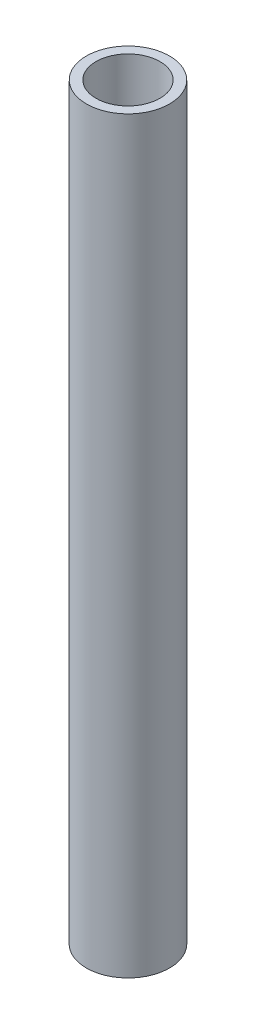
ISO-10303-21;
HEADER;
FILE_DESCRIPTION(('STEP AP214'),'2;1');
FILE_NAME('part.step','',(''),(''),'','','');
FILE_SCHEMA(('AUTOMOTIVE_DESIGN { 1 0 10303 214 1 1 1 1 }'));
ENDSEC;
DATA;
#1=APPLICATION_CONTEXT('core data for automotive mechanical design processes');
#2=APPLICATION_PROTOCOL_DEFINITION('international standard','automotive_design',2000,#1);
#3=PRODUCT_CONTEXT('',#1,'mechanical');
#4=PRODUCT('Part','Part','',(#3));
#5=PRODUCT_RELATED_PRODUCT_CATEGORY('part','',(#4));
#6=PRODUCT_DEFINITION_FORMATION('','',#4);
#7=PRODUCT_DEFINITION_CONTEXT('part definition',#1,'design');
#8=PRODUCT_DEFINITION('design','',#6,#7);
#9=PRODUCT_DEFINITION_SHAPE('','',#8);
#10=(LENGTH_UNIT() NAMED_UNIT(*) SI_UNIT(.MILLI.,.METRE.));
#11=(NAMED_UNIT(*) PLANE_ANGLE_UNIT() SI_UNIT($,.RADIAN.));
#12=(NAMED_UNIT(*) SI_UNIT($,.STERADIAN.) SOLID_ANGLE_UNIT());
#13=UNCERTAINTY_MEASURE_WITH_UNIT(LENGTH_MEASURE(1.E-05),#10,'distance_accuracy_value','');
#14=(GEOMETRIC_REPRESENTATION_CONTEXT(3) GLOBAL_UNCERTAINTY_ASSIGNED_CONTEXT((#13)) GLOBAL_UNIT_ASSIGNED_CONTEXT((#10,
#11,#12)) REPRESENTATION_CONTEXT('',''));
#15=CARTESIAN_POINT('',(0.,0.,0.));
#16=DIRECTION('',(0.,0.,1.));
#17=DIRECTION('',(1.,0.,0.));
#18=AXIS2_PLACEMENT_3D('',#15,#16,#17);
#19=CARTESIAN_POINT('',(0.,114.3,0.));
#20=DIRECTION('',(0.,1.,0.));
#21=DIRECTION('',(0.,0.,1.));
#22=AXIS2_PLACEMENT_3D('',#19,#20,#21);
#23=PLANE('',#22);
#24=CARTESIAN_POINT('',(0.,114.3,0.));
#25=DIRECTION('',(0.,1.,0.));
#26=DIRECTION('',(0.,0.,1.));
#27=AXIS2_PLACEMENT_3D('',#24,#25,#26);
#28=CIRCLE('',#27,6.35);
#29=CARTESIAN_POINT('',(0.,114.3,6.35));
#30=VERTEX_POINT('',#29);
#31=EDGE_CURVE('E10',#30,#30,#28,.T.);
#32=ORIENTED_EDGE('',*,*,#31,.T.);
#33=EDGE_LOOP('',(#32));
#34=FACE_BOUND('',#33,.T.);
#35=CARTESIAN_POINT('',(0.,114.3,0.));
#36=DIRECTION('',(0.,1.,0.));
#37=DIRECTION('',(0.,0.,1.));
#38=AXIS2_PLACEMENT_3D('',#35,#36,#37);
#39=CIRCLE('',#38,4.8768);
#40=CARTESIAN_POINT('',(0.,114.3,4.8768));
#41=VERTEX_POINT('',#40);
#42=EDGE_CURVE('E42',#41,#41,#39,.T.);
#43=ORIENTED_EDGE('',*,*,#42,.F.);
#44=EDGE_LOOP('',(#43));
#45=FACE_BOUND('',#44,.T.);
#46=ADVANCED_FACE('F31',(#34,#45),#23,.T.);
#47=CARTESIAN_POINT('',(0.,0.,0.));
#48=DIRECTION('',(0.,1.,0.));
#49=DIRECTION('',(0.,0.,1.));
#50=AXIS2_PLACEMENT_3D('',#47,#48,#49);
#51=PLANE('',#50);
#52=CARTESIAN_POINT('',(0.,0.,0.));
#53=DIRECTION('',(0.,1.,0.));
#54=DIRECTION('',(0.,0.,1.));
#55=AXIS2_PLACEMENT_3D('',#52,#53,#54);
#56=CIRCLE('',#55,6.35);
#57=CARTESIAN_POINT('',(0.,0.,6.35));
#58=VERTEX_POINT('',#57);
#59=EDGE_CURVE('E35',#58,#58,#56,.T.);
#60=ORIENTED_EDGE('',*,*,#59,.F.);
#61=EDGE_LOOP('',(#60));
#62=FACE_BOUND('',#61,.T.);
#63=CARTESIAN_POINT('',(0.,0.,0.));
#64=DIRECTION('',(0.,1.,0.));
#65=DIRECTION('',(0.,0.,1.));
#66=AXIS2_PLACEMENT_3D('',#63,#64,#65);
#67=CIRCLE('',#66,4.8768);
#68=CARTESIAN_POINT('',(0.,0.,4.8768));
#69=VERTEX_POINT('',#68);
#70=EDGE_CURVE('E44',#69,#69,#67,.T.);
#71=ORIENTED_EDGE('',*,*,#70,.T.);
#72=EDGE_LOOP('',(#71));
#73=FACE_BOUND('',#72,.T.);
#74=ADVANCED_FACE('F54',(#62,#73),#51,.F.);
#75=CARTESIAN_POINT('',(0.,114.3,0.));
#76=DIRECTION('',(0.,-1.,0.));
#77=DIRECTION('',(0.,0.,-1.));
#78=AXIS2_PLACEMENT_3D('',#75,#76,#77);
#79=CYLINDRICAL_SURFACE('',#78,6.35);
#80=ORIENTED_EDGE('',*,*,#31,.F.);
#81=EDGE_LOOP('',(#80));
#82=FACE_BOUND('',#81,.T.);
#83=ORIENTED_EDGE('',*,*,#59,.T.);
#84=EDGE_LOOP('',(#83));
#85=FACE_BOUND('',#84,.T.);
#86=ADVANCED_FACE('F33',(#82,#85),#79,.T.);
#87=CARTESIAN_POINT('',(0.,114.3,0.));
#88=DIRECTION('',(0.,-1.,0.));
#89=DIRECTION('',(0.,0.,-1.));
#90=AXIS2_PLACEMENT_3D('',#87,#88,#89);
#91=CYLINDRICAL_SURFACE('',#90,4.8768);
#92=ORIENTED_EDGE('',*,*,#42,.T.);
#93=EDGE_LOOP('',(#92));
#94=FACE_BOUND('',#93,.T.);
#95=ORIENTED_EDGE('',*,*,#70,.F.);
#96=EDGE_LOOP('',(#95));
#97=FACE_BOUND('',#96,.T.);
#98=ADVANCED_FACE('F50',(#94,#97),#91,.F.);
#99=CLOSED_SHELL('',(#46,#74,#86,#98));
#100=MANIFOLD_SOLID_BREP('B2',#99);
#101=ADVANCED_BREP_SHAPE_REPRESENTATION('',(#18,#100),#14);
#102=SHAPE_DEFINITION_REPRESENTATION(#9,#101);
ENDSEC;
END-ISO-10303-21;
